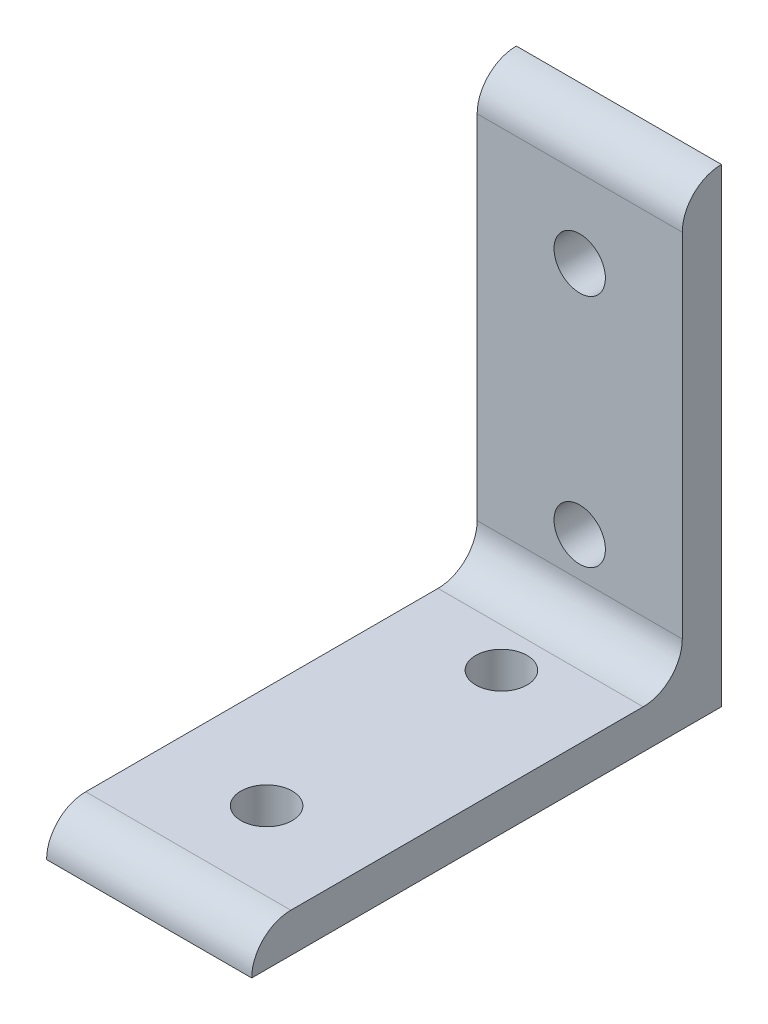
ISO-10303-21;
HEADER;
FILE_DESCRIPTION(('STEP AP214'),'2;1');
FILE_NAME('part.step','',(''),(''),'','','');
FILE_SCHEMA(('AUTOMOTIVE_DESIGN { 1 0 10303 214 1 1 1 1 }'));
ENDSEC;
DATA;
#1=APPLICATION_CONTEXT('core data for automotive mechanical design processes');
#2=APPLICATION_PROTOCOL_DEFINITION('international standard','automotive_design',2000,#1);
#3=PRODUCT_CONTEXT('',#1,'mechanical');
#4=PRODUCT('Part','Part','',(#3));
#5=PRODUCT_RELATED_PRODUCT_CATEGORY('part','',(#4));
#6=PRODUCT_DEFINITION_FORMATION('','',#4);
#7=PRODUCT_DEFINITION_CONTEXT('part definition',#1,'design');
#8=PRODUCT_DEFINITION('design','',#6,#7);
#9=PRODUCT_DEFINITION_SHAPE('','',#8);
#10=(LENGTH_UNIT() NAMED_UNIT(*) SI_UNIT(.MILLI.,.METRE.));
#11=(NAMED_UNIT(*) PLANE_ANGLE_UNIT() SI_UNIT($,.RADIAN.));
#12=(NAMED_UNIT(*) SI_UNIT($,.STERADIAN.) SOLID_ANGLE_UNIT());
#13=UNCERTAINTY_MEASURE_WITH_UNIT(LENGTH_MEASURE(1.E-05),#10,'distance_accuracy_value','');
#14=(GEOMETRIC_REPRESENTATION_CONTEXT(3) GLOBAL_UNCERTAINTY_ASSIGNED_CONTEXT((#13)) GLOBAL_UNIT_ASSIGNED_CONTEXT((#10,
#11,#12)) REPRESENTATION_CONTEXT('',''));
#15=CARTESIAN_POINT('',(0.,0.,0.));
#16=DIRECTION('',(0.,0.,1.));
#17=DIRECTION('',(1.,0.,0.));
#18=AXIS2_PLACEMENT_3D('',#15,#16,#17);
#19=CARTESIAN_POINT('',(-16.637,12.7,12.7));
#20=DIRECTION('',(1.,0.,0.));
#21=DIRECTION('',(0.,0.,-1.));
#22=AXIS2_PLACEMENT_3D('',#19,#20,#21);
#23=CYLINDRICAL_SURFACE('',#22,6.35);
#24=CARTESIAN_POINT('',(16.637,12.7,12.7));
#25=DIRECTION('',(-1.,0.,0.));
#26=DIRECTION('',(0.,0.,-1.));
#27=AXIS2_PLACEMENT_3D('',#24,#25,#26);
#28=CIRCLE('',#27,6.35);
#29=CARTESIAN_POINT('',(16.637,12.7,6.35));
#30=VERTEX_POINT('',#29);
#31=CARTESIAN_POINT('',(16.637,6.35,12.7));
#32=VERTEX_POINT('',#31);
#33=EDGE_CURVE('E126',#30,#32,#28,.T.);
#34=ORIENTED_EDGE('',*,*,#33,.F.);
#35=DIRECTION('',(1.,0.,0.));
#36=VECTOR('',#35,1.);
#37=CARTESIAN_POINT('',(-16.637,12.7,6.35));
#38=LINE('',#37,#36);
#39=CARTESIAN_POINT('',(-16.637,12.7,6.35));
#40=VERTEX_POINT('',#39);
#41=EDGE_CURVE('E11',#40,#30,#38,.T.);
#42=ORIENTED_EDGE('',*,*,#41,.F.);
#43=CARTESIAN_POINT('',(-16.637,12.7,12.7));
#44=DIRECTION('',(-1.,0.,0.));
#45=DIRECTION('',(0.,0.,-1.));
#46=AXIS2_PLACEMENT_3D('',#43,#44,#45);
#47=CIRCLE('',#46,6.35);
#48=CARTESIAN_POINT('',(-16.637,6.35,12.7));
#49=VERTEX_POINT('',#48);
#50=EDGE_CURVE('E143',#40,#49,#47,.T.);
#51=ORIENTED_EDGE('',*,*,#50,.T.);
#52=DIRECTION('',(1.,0.,0.));
#53=VECTOR('',#52,1.);
#54=CARTESIAN_POINT('',(-16.637,6.35,12.7));
#55=LINE('',#54,#53);
#56=EDGE_CURVE('E87',#49,#32,#55,.T.);
#57=ORIENTED_EDGE('',*,*,#56,.T.);
#58=EDGE_LOOP('',(#34,#42,#51,#57));
#59=FACE_BOUND('',#58,.T.);
#60=ADVANCED_FACE('F34',(#59),#23,.F.);
#61=CARTESIAN_POINT('',(-16.637,12.7,6.35));
#62=DIRECTION('',(0.,0.,1.));
#63=DIRECTION('',(0.,-1.,0.));
#64=AXIS2_PLACEMENT_3D('',#61,#62,#63);
#65=PLANE('',#64);
#66=CARTESIAN_POINT('',(0.,57.15,6.35000000000002));
#67=DIRECTION('',(0.,0.,1.));
#68=DIRECTION('',(0.,-1.,0.));
#69=AXIS2_PLACEMENT_3D('',#66,#67,#68);
#70=CIRCLE('',#69,4.1656);
#71=CARTESIAN_POINT('',(0.,61.3156,6.35000000000001));
#72=VERTEX_POINT('',#71);
#73=EDGE_CURVE('E216',#72,#72,#70,.T.);
#74=ORIENTED_EDGE('',*,*,#73,.F.);
#75=EDGE_LOOP('',(#74));
#76=FACE_BOUND('',#75,.T.);
#77=CARTESIAN_POINT('',(0.,19.05,6.35000000000001));
#78=DIRECTION('',(0.,0.,1.));
#79=DIRECTION('',(0.,-1.,0.));
#80=AXIS2_PLACEMENT_3D('',#77,#78,#79);
#81=CIRCLE('',#80,4.1656);
#82=CARTESIAN_POINT('',(0.,23.2156,6.35000000000002));
#83=VERTEX_POINT('',#82);
#84=EDGE_CURVE('E207',#83,#83,#81,.T.);
#85=ORIENTED_EDGE('',*,*,#84,.F.);
#86=EDGE_LOOP('',(#85));
#87=FACE_BOUND('',#86,.T.);
#88=DIRECTION('',(0.,-1.,0.));
#89=VECTOR('',#88,1.);
#90=CARTESIAN_POINT('',(16.637,12.7,6.35));
#91=LINE('',#90,#89);
#92=CARTESIAN_POINT('',(16.637,69.85,6.35000000000001));
#93=VERTEX_POINT('',#92);
#94=EDGE_CURVE('E141',#93,#30,#91,.T.);
#95=ORIENTED_EDGE('',*,*,#94,.F.);
#96=DIRECTION('',(1.,0.,0.));
#97=VECTOR('',#96,1.);
#98=CARTESIAN_POINT('',(-16.637,69.85,6.35000000000001));
#99=LINE('',#98,#97);
#100=CARTESIAN_POINT('',(-16.637,69.85,6.35000000000001));
#101=VERTEX_POINT('',#100);
#102=EDGE_CURVE('E43',#101,#93,#99,.T.);
#103=ORIENTED_EDGE('',*,*,#102,.F.);
#104=DIRECTION('',(0.,-1.,0.));
#105=VECTOR('',#104,1.);
#106=CARTESIAN_POINT('',(-16.637,12.7,6.35));
#107=LINE('',#106,#105);
#108=EDGE_CURVE('E116',#101,#40,#107,.T.);
#109=ORIENTED_EDGE('',*,*,#108,.T.);
#110=ORIENTED_EDGE('',*,*,#41,.T.);
#111=EDGE_LOOP('',(#95,#103,#109,#110));
#112=FACE_BOUND('',#111,.T.);
#113=ADVANCED_FACE('F154',(#76,#87,#112),#65,.T.);
#114=CARTESIAN_POINT('',(-16.637,69.85,0.));
#115=DIRECTION('',(1.,0.,0.));
#116=DIRECTION('',(0.,0.,-1.));
#117=AXIS2_PLACEMENT_3D('',#114,#115,#116);
#118=CYLINDRICAL_SURFACE('',#117,6.34999999999999);
#119=CARTESIAN_POINT('',(16.637,69.85,0.));
#120=DIRECTION('',(1.,0.,0.));
#121=DIRECTION('',(0.,0.,-1.));
#122=AXIS2_PLACEMENT_3D('',#119,#120,#121);
#123=CIRCLE('',#122,6.34999999999999);
#124=CARTESIAN_POINT('',(16.637,76.2,0.));
#125=VERTEX_POINT('',#124);
#126=EDGE_CURVE('E103',#125,#93,#123,.T.);
#127=ORIENTED_EDGE('',*,*,#126,.F.);
#128=DIRECTION('',(1.,0.,0.));
#129=VECTOR('',#128,1.);
#130=CARTESIAN_POINT('',(-16.637,76.2,0.));
#131=LINE('',#130,#129);
#132=CARTESIAN_POINT('',(-16.637,76.2,0.));
#133=VERTEX_POINT('',#132);
#134=EDGE_CURVE('E98',#133,#125,#131,.T.);
#135=ORIENTED_EDGE('',*,*,#134,.F.);
#136=CARTESIAN_POINT('',(-16.637,69.85,0.));
#137=DIRECTION('',(1.,0.,0.));
#138=DIRECTION('',(0.,0.,-1.));
#139=AXIS2_PLACEMENT_3D('',#136,#137,#138);
#140=CIRCLE('',#139,6.34999999999999);
#141=EDGE_CURVE('E101',#133,#101,#140,.T.);
#142=ORIENTED_EDGE('',*,*,#141,.T.);
#143=ORIENTED_EDGE('',*,*,#102,.T.);
#144=EDGE_LOOP('',(#127,#135,#142,#143));
#145=FACE_BOUND('',#144,.T.);
#146=ADVANCED_FACE('F100',(#145),#118,.T.);
#147=CARTESIAN_POINT('',(-16.637,0.,0.));
#148=DIRECTION('',(0.,0.,-1.));
#149=DIRECTION('',(0.,1.,0.));
#150=AXIS2_PLACEMENT_3D('',#147,#148,#149);
#151=PLANE('',#150);
#152=CARTESIAN_POINT('',(0.,57.15,0.));
#153=DIRECTION('',(0.,0.,-1.));
#154=DIRECTION('',(0.,1.,0.));
#155=AXIS2_PLACEMENT_3D('',#152,#153,#154);
#156=CIRCLE('',#155,4.1656);
#157=CARTESIAN_POINT('',(0.,61.3156,0.));
#158=VERTEX_POINT('',#157);
#159=EDGE_CURVE('E213',#158,#158,#156,.T.);
#160=ORIENTED_EDGE('',*,*,#159,.F.);
#161=EDGE_LOOP('',(#160));
#162=FACE_BOUND('',#161,.T.);
#163=CARTESIAN_POINT('',(0.,19.05,0.));
#164=DIRECTION('',(0.,0.,-1.));
#165=DIRECTION('',(0.,1.,0.));
#166=AXIS2_PLACEMENT_3D('',#163,#164,#165);
#167=CIRCLE('',#166,4.1656);
#168=CARTESIAN_POINT('',(0.,23.2156,0.));
#169=VERTEX_POINT('',#168);
#170=EDGE_CURVE('E210',#169,#169,#167,.T.);
#171=ORIENTED_EDGE('',*,*,#170,.F.);
#172=EDGE_LOOP('',(#171));
#173=FACE_BOUND('',#172,.T.);
#174=DIRECTION('',(0.,1.,0.));
#175=VECTOR('',#174,1.);
#176=CARTESIAN_POINT('',(16.637,0.,0.));
#177=LINE('',#176,#175);
#178=CARTESIAN_POINT('',(16.637,0.,0.));
#179=VERTEX_POINT('',#178);
#180=EDGE_CURVE('E138',#179,#125,#177,.T.);
#181=ORIENTED_EDGE('',*,*,#180,.F.);
#182=DIRECTION('',(1.,0.,0.));
#183=VECTOR('',#182,1.);
#184=CARTESIAN_POINT('',(-16.637,0.,0.));
#185=LINE('',#184,#183);
#186=CARTESIAN_POINT('',(-16.637,0.,0.));
#187=VERTEX_POINT('',#186);
#188=EDGE_CURVE('E108',#187,#179,#185,.T.);
#189=ORIENTED_EDGE('',*,*,#188,.F.);
#190=DIRECTION('',(0.,1.,0.));
#191=VECTOR('',#190,1.);
#192=CARTESIAN_POINT('',(-16.637,0.,0.));
#193=LINE('',#192,#191);
#194=EDGE_CURVE('E114',#187,#133,#193,.T.);
#195=ORIENTED_EDGE('',*,*,#194,.T.);
#196=ORIENTED_EDGE('',*,*,#134,.T.);
#197=EDGE_LOOP('',(#181,#189,#195,#196));
#198=FACE_BOUND('',#197,.T.);
#199=ADVANCED_FACE('F118',(#162,#173,#198),#151,.T.);
#200=CARTESIAN_POINT('',(-16.637,0.,76.2));
#201=DIRECTION('',(0.,-1.,0.));
#202=DIRECTION('',(0.,0.,-1.));
#203=AXIS2_PLACEMENT_3D('',#200,#201,#202);
#204=PLANE('',#203);
#205=CARTESIAN_POINT('',(0.,0.,57.15));
#206=DIRECTION('',(0.,-1.,0.));
#207=DIRECTION('',(0.,0.,-1.));
#208=AXIS2_PLACEMENT_3D('',#205,#206,#207);
#209=CIRCLE('',#208,4.1656);
#210=CARTESIAN_POINT('',(0.,0.,52.9844));
#211=VERTEX_POINT('',#210);
#212=EDGE_CURVE('E192',#211,#211,#209,.T.);
#213=ORIENTED_EDGE('',*,*,#212,.F.);
#214=EDGE_LOOP('',(#213));
#215=FACE_BOUND('',#214,.T.);
#216=CARTESIAN_POINT('',(0.,0.,19.05));
#217=DIRECTION('',(0.,-1.,0.));
#218=DIRECTION('',(0.,0.,-1.));
#219=AXIS2_PLACEMENT_3D('',#216,#217,#218);
#220=CIRCLE('',#219,4.1656);
#221=CARTESIAN_POINT('',(0.,0.,14.8844));
#222=VERTEX_POINT('',#221);
#223=EDGE_CURVE('E190',#222,#222,#220,.T.);
#224=ORIENTED_EDGE('',*,*,#223,.F.);
#225=EDGE_LOOP('',(#224));
#226=FACE_BOUND('',#225,.T.);
#227=DIRECTION('',(0.,0.,-1.));
#228=VECTOR('',#227,1.);
#229=CARTESIAN_POINT('',(16.637,0.,76.2));
#230=LINE('',#229,#228);
#231=CARTESIAN_POINT('',(16.637,0.,76.2));
#232=VERTEX_POINT('',#231);
#233=EDGE_CURVE('E135',#232,#179,#230,.T.);
#234=ORIENTED_EDGE('',*,*,#233,.F.);
#235=DIRECTION('',(1.,0.,0.));
#236=VECTOR('',#235,1.);
#237=CARTESIAN_POINT('',(-16.637,0.,76.2));
#238=LINE('',#237,#236);
#239=CARTESIAN_POINT('',(-16.637,0.,76.2));
#240=VERTEX_POINT('',#239);
#241=EDGE_CURVE('E147',#240,#232,#238,.T.);
#242=ORIENTED_EDGE('',*,*,#241,.F.);
#243=DIRECTION('',(0.,0.,-1.));
#244=VECTOR('',#243,1.);
#245=CARTESIAN_POINT('',(-16.637,0.,76.2));
#246=LINE('',#245,#244);
#247=EDGE_CURVE('E119',#240,#187,#246,.T.);
#248=ORIENTED_EDGE('',*,*,#247,.T.);
#249=ORIENTED_EDGE('',*,*,#188,.T.);
#250=EDGE_LOOP('',(#234,#242,#248,#249));
#251=FACE_BOUND('',#250,.T.);
#252=ADVANCED_FACE('F170',(#215,#226,#251),#204,.T.);
#253=CARTESIAN_POINT('',(-16.637,0.,69.85));
#254=DIRECTION('',(1.,0.,0.));
#255=DIRECTION('',(0.,0.,-1.));
#256=AXIS2_PLACEMENT_3D('',#253,#254,#255);
#257=CYLINDRICAL_SURFACE('',#256,6.35);
#258=CARTESIAN_POINT('',(16.637,0.,69.85));
#259=DIRECTION('',(1.,0.,0.));
#260=DIRECTION('',(0.,0.,-1.));
#261=AXIS2_PLACEMENT_3D('',#258,#259,#260);
#262=CIRCLE('',#261,6.35);
#263=CARTESIAN_POINT('',(16.637,6.35,69.85));
#264=VERTEX_POINT('',#263);
#265=EDGE_CURVE('E132',#264,#232,#262,.T.);
#266=ORIENTED_EDGE('',*,*,#265,.F.);
#267=DIRECTION('',(1.,0.,0.));
#268=VECTOR('',#267,1.);
#269=CARTESIAN_POINT('',(-16.637,6.35,69.85));
#270=LINE('',#269,#268);
#271=CARTESIAN_POINT('',(-16.637,6.35,69.85));
#272=VERTEX_POINT('',#271);
#273=EDGE_CURVE('E149',#272,#264,#270,.T.);
#274=ORIENTED_EDGE('',*,*,#273,.F.);
#275=CARTESIAN_POINT('',(-16.637,0.,69.85));
#276=DIRECTION('',(1.,0.,0.));
#277=DIRECTION('',(0.,0.,-1.));
#278=AXIS2_PLACEMENT_3D('',#275,#276,#277);
#279=CIRCLE('',#278,6.35);
#280=EDGE_CURVE('E121',#272,#240,#279,.T.);
#281=ORIENTED_EDGE('',*,*,#280,.T.);
#282=ORIENTED_EDGE('',*,*,#241,.T.);
#283=EDGE_LOOP('',(#266,#274,#281,#282));
#284=FACE_BOUND('',#283,.T.);
#285=ADVANCED_FACE('F174',(#284),#257,.T.);
#286=CARTESIAN_POINT('',(-16.637,6.35,69.85));
#287=DIRECTION('',(0.,1.,0.));
#288=DIRECTION('',(0.,0.,1.));
#289=AXIS2_PLACEMENT_3D('',#286,#287,#288);
#290=PLANE('',#289);
#291=CARTESIAN_POINT('',(0.,6.34999999999999,57.15));
#292=DIRECTION('',(0.,1.,0.));
#293=DIRECTION('',(0.,0.,1.));
#294=AXIS2_PLACEMENT_3D('',#291,#292,#293);
#295=CIRCLE('',#294,4.1656);
#296=CARTESIAN_POINT('',(0.,6.34999999999999,61.3156));
#297=VERTEX_POINT('',#296);
#298=EDGE_CURVE('E186',#297,#297,#295,.T.);
#299=ORIENTED_EDGE('',*,*,#298,.F.);
#300=EDGE_LOOP('',(#299));
#301=FACE_BOUND('',#300,.T.);
#302=CARTESIAN_POINT('',(0.,6.34999999999999,19.05));
#303=DIRECTION('',(0.,1.,0.));
#304=DIRECTION('',(0.,0.,1.));
#305=AXIS2_PLACEMENT_3D('',#302,#303,#304);
#306=CIRCLE('',#305,4.1656);
#307=CARTESIAN_POINT('',(0.,6.34999999999999,23.2156));
#308=VERTEX_POINT('',#307);
#309=EDGE_CURVE('E37',#308,#308,#306,.T.);
#310=ORIENTED_EDGE('',*,*,#309,.F.);
#311=EDGE_LOOP('',(#310));
#312=FACE_BOUND('',#311,.T.);
#313=DIRECTION('',(0.,0.,1.));
#314=VECTOR('',#313,1.);
#315=CARTESIAN_POINT('',(16.637,6.35,69.85));
#316=LINE('',#315,#314);
#317=EDGE_CURVE('E129',#32,#264,#316,.T.);
#318=ORIENTED_EDGE('',*,*,#317,.F.);
#319=ORIENTED_EDGE('',*,*,#56,.F.);
#320=DIRECTION('',(0.,0.,1.));
#321=VECTOR('',#320,1.);
#322=CARTESIAN_POINT('',(-16.637,6.35,69.85));
#323=LINE('',#322,#321);
#324=EDGE_CURVE('E201',#49,#272,#323,.T.);
#325=ORIENTED_EDGE('',*,*,#324,.T.);
#326=ORIENTED_EDGE('',*,*,#273,.T.);
#327=EDGE_LOOP('',(#318,#319,#325,#326));
#328=FACE_BOUND('',#327,.T.);
#329=ADVANCED_FACE('F150',(#301,#312,#328),#290,.T.);
#330=CARTESIAN_POINT('',(-16.637,12.7,12.7));
#331=DIRECTION('',(1.,0.,0.));
#332=DIRECTION('',(0.,0.,-1.));
#333=AXIS2_PLACEMENT_3D('',#330,#331,#332);
#334=PLANE('',#333);
#335=ORIENTED_EDGE('',*,*,#50,.F.);
#336=ORIENTED_EDGE('',*,*,#108,.F.);
#337=ORIENTED_EDGE('',*,*,#141,.F.);
#338=ORIENTED_EDGE('',*,*,#194,.F.);
#339=ORIENTED_EDGE('',*,*,#247,.F.);
#340=ORIENTED_EDGE('',*,*,#280,.F.);
#341=ORIENTED_EDGE('',*,*,#324,.F.);
#342=EDGE_LOOP('',(#335,#336,#337,#338,#339,#340,#341));
#343=FACE_BOUND('',#342,.T.);
#344=ADVANCED_FACE('F112',(#343),#334,.F.);
#345=CARTESIAN_POINT('',(16.637,12.7,12.7));
#346=DIRECTION('',(1.,0.,0.));
#347=DIRECTION('',(0.,0.,-1.));
#348=AXIS2_PLACEMENT_3D('',#345,#346,#347);
#349=PLANE('',#348);
#350=ORIENTED_EDGE('',*,*,#33,.T.);
#351=ORIENTED_EDGE('',*,*,#317,.T.);
#352=ORIENTED_EDGE('',*,*,#265,.T.);
#353=ORIENTED_EDGE('',*,*,#233,.T.);
#354=ORIENTED_EDGE('',*,*,#180,.T.);
#355=ORIENTED_EDGE('',*,*,#126,.T.);
#356=ORIENTED_EDGE('',*,*,#94,.T.);
#357=EDGE_LOOP('',(#350,#351,#352,#353,#354,#355,#356));
#358=FACE_BOUND('',#357,.T.);
#359=ADVANCED_FACE('F153',(#358),#349,.T.);
#360=CARTESIAN_POINT('',(0.,76.2,19.05));
#361=DIRECTION('',(0.,-1.,0.));
#362=DIRECTION('',(0.,0.,-1.));
#363=AXIS2_PLACEMENT_3D('',#360,#361,#362);
#364=CYLINDRICAL_SURFACE('',#363,4.1656);
#365=ORIENTED_EDGE('',*,*,#309,.T.);
#366=EDGE_LOOP('',(#365));
#367=FACE_BOUND('',#366,.T.);
#368=ORIENTED_EDGE('',*,*,#223,.T.);
#369=EDGE_LOOP('',(#368));
#370=FACE_BOUND('',#369,.T.);
#371=ADVANCED_FACE('F235',(#367,#370),#364,.F.);
#372=CARTESIAN_POINT('',(0.,76.2,57.15));
#373=DIRECTION('',(0.,-1.,0.));
#374=DIRECTION('',(0.,0.,-1.));
#375=AXIS2_PLACEMENT_3D('',#372,#373,#374);
#376=CYLINDRICAL_SURFACE('',#375,4.1656);
#377=ORIENTED_EDGE('',*,*,#298,.T.);
#378=EDGE_LOOP('',(#377));
#379=FACE_BOUND('',#378,.T.);
#380=ORIENTED_EDGE('',*,*,#212,.T.);
#381=EDGE_LOOP('',(#380));
#382=FACE_BOUND('',#381,.T.);
#383=ADVANCED_FACE('F229',(#379,#382),#376,.F.);
#384=CARTESIAN_POINT('',(0.,19.05,76.2));
#385=DIRECTION('',(0.,0.,-1.));
#386=DIRECTION('',(0.,1.,0.));
#387=AXIS2_PLACEMENT_3D('',#384,#385,#386);
#388=CYLINDRICAL_SURFACE('',#387,4.1656);
#389=CARTESIAN_POINT('',(0.,23.2156,6.35000000000002));
#390=CARTESIAN_POINT('',(0.,23.2156,6.28385416666669));
#391=CARTESIAN_POINT('',(0.,23.2156,6.21770833333336));
#392=CARTESIAN_POINT('',(0.,23.2156,6.08541666666669));
#393=CARTESIAN_POINT('',(0.,23.2156,6.01927083333335));
#394=CARTESIAN_POINT('',(0.,23.2156,5.88697916666669));
#395=CARTESIAN_POINT('',(0.,23.2156,5.82083333333335));
#396=CARTESIAN_POINT('',(0.,23.2156,5.68854166666669));
#397=CARTESIAN_POINT('',(0.,23.2156,5.62239583333335));
#398=CARTESIAN_POINT('',(0.,23.2156,5.49010416666668));
#399=CARTESIAN_POINT('',(0.,23.2156,5.42395833333335));
#400=CARTESIAN_POINT('',(0.,23.2156,5.29166666666668));
#401=CARTESIAN_POINT('',(0.,23.2156,5.22552083333335));
#402=CARTESIAN_POINT('',(0.,23.2156,5.09322916666668));
#403=CARTESIAN_POINT('',(0.,23.2156,5.02708333333335));
#404=CARTESIAN_POINT('',(0.,23.2156,4.89479166666668));
#405=CARTESIAN_POINT('',(0.,23.2156,4.82864583333335));
#406=CARTESIAN_POINT('',(0.,23.2156,4.69635416666668));
#407=CARTESIAN_POINT('',(0.,23.2156,4.63020833333335));
#408=CARTESIAN_POINT('',(0.,23.2156,4.49791666666668));
#409=CARTESIAN_POINT('',(0.,23.2156,4.43177083333335));
#410=CARTESIAN_POINT('',(0.,23.2156,4.29947916666668));
#411=CARTESIAN_POINT('',(0.,23.2156,4.23333333333335));
#412=CARTESIAN_POINT('',(0.,23.2156,4.10104166666668));
#413=CARTESIAN_POINT('',(0.,23.2156,4.03489583333335));
#414=CARTESIAN_POINT('',(0.,23.2156,3.90260416666668));
#415=CARTESIAN_POINT('',(0.,23.2156,3.83645833333335));
#416=CARTESIAN_POINT('',(0.,23.2156,3.70416666666668));
#417=CARTESIAN_POINT('',(0.,23.2156,3.63802083333335));
#418=CARTESIAN_POINT('',(0.,23.2156,3.50572916666668));
#419=CARTESIAN_POINT('',(0.,23.2156,3.43958333333334));
#420=CARTESIAN_POINT('',(0.,23.2156,3.30729166666667));
#421=CARTESIAN_POINT('',(0.,23.2156,3.24114583333334));
#422=CARTESIAN_POINT('',(0.,23.2156,3.10885416666668));
#423=CARTESIAN_POINT('',(0.,23.2156,3.04270833333335));
#424=CARTESIAN_POINT('',(0.,23.2156,2.91041666666668));
#425=CARTESIAN_POINT('',(0.,23.2156,2.84427083333334));
#426=CARTESIAN_POINT('',(0.,23.2156,2.71197916666667));
#427=CARTESIAN_POINT('',(0.,23.2156,2.64583333333334));
#428=CARTESIAN_POINT('',(0.,23.2156,2.51354166666667));
#429=CARTESIAN_POINT('',(0.,23.2156,2.44739583333334));
#430=CARTESIAN_POINT('',(0.,23.2156,2.31510416666667));
#431=CARTESIAN_POINT('',(0.,23.2156,2.24895833333334));
#432=CARTESIAN_POINT('',(0.,23.2156,2.11666666666667));
#433=CARTESIAN_POINT('',(0.,23.2156,2.05052083333334));
#434=CARTESIAN_POINT('',(0.,23.2156,1.91822916666667));
#435=CARTESIAN_POINT('',(0.,23.2156,1.85208333333334));
#436=CARTESIAN_POINT('',(0.,23.2156,1.71979166666667));
#437=CARTESIAN_POINT('',(0.,23.2156,1.65364583333334));
#438=CARTESIAN_POINT('',(0.,23.2156,1.52135416666667));
#439=CARTESIAN_POINT('',(0.,23.2156,1.45520833333334));
#440=CARTESIAN_POINT('',(0.,23.2156,1.32291666666667));
#441=CARTESIAN_POINT('',(0.,23.2156,1.25677083333334));
#442=CARTESIAN_POINT('',(0.,23.2156,1.12447916666667));
#443=CARTESIAN_POINT('',(0.,23.2156,1.05833333333334));
#444=CARTESIAN_POINT('',(0.,23.2156,0.926041666666673));
#445=CARTESIAN_POINT('',(0.,23.2156,0.859895833333342));
#446=CARTESIAN_POINT('',(0.,23.2156,0.727604166666673));
#447=CARTESIAN_POINT('',(0.,23.2156,0.661458333333337));
#448=CARTESIAN_POINT('',(0.,23.2156,0.529166666666669));
#449=CARTESIAN_POINT('',(0.,23.2156,0.463020833333337));
#450=CARTESIAN_POINT('',(0.,23.2156,0.330729166666668));
#451=CARTESIAN_POINT('',(0.,23.2156,0.264583333333332));
#452=CARTESIAN_POINT('',(0.,23.2156,0.132291666666664));
#453=CARTESIAN_POINT('',(0.,23.2156,0.0661458333333318));
#454=CARTESIAN_POINT('',(0.,23.2156,0.));
#455=B_SPLINE_CURVE_WITH_KNOTS('',3,(#389,#390,#391,#392,#393,#394,#395,#396,#397,#398,#399,
#400,#401,#402,#403,#404,#405,#406,#407,#408,#409,#410,#411,#412,#413,#414,#415,#416,#417,#418,
#419,#420,#421,#422,#423,#424,#425,#426,#427,#428,#429,#430,#431,#432,#433,#434,#435,#436,#437,
#438,#439,#440,#441,#442,#443,#444,#445,#446,#447,#448,#449,#450,#451,#452,#453,#454),
.UNSPECIFIED.,.F.,.F.,(4,2,2,2,2,2,2,2,2,2,2,2,2,2,2,2,2,2,2,2,2,2,2,2,2,2,2,2,2,2,2,2,4),(0.,
0.198437499999995,0.396875000000005,0.5953125,0.79375000000001,0.992187500000005,1.190625,
1.38906250000001,1.58750000000001,1.7859375,1.98437500000001,2.18281250000001,2.38125,
2.57968750000001,2.77812500000001,2.97656250000002,3.17500000000001,3.37343750000001,
3.57187500000002,3.77031250000001,3.96875000000002,4.16718750000002,4.36562500000001,
4.56406250000002,4.76250000000002,4.96093750000001,5.15937500000002,5.35781250000002,
5.55625000000001,5.75468750000002,5.95312500000002,6.15156250000003,6.35000000000002),.UNSPECIFIED.);
#456=EDGE_CURVE('BSEAM222',#83,#169,#455,.T.);
#457=ORIENTED_EDGE('',*,*,#84,.T.);
#458=ORIENTED_EDGE('',*,*,#170,.T.);
#459=ORIENTED_EDGE('',*,*,#456,.T.);
#460=ORIENTED_EDGE('',*,*,#456,.F.);
#461=EDGE_LOOP('',(#457,#459,#458,#460));
#462=FACE_BOUND('',#461,.T.);
#463=ADVANCED_FACE('F222',(#462),#388,.F.);
#464=CARTESIAN_POINT('',(0.,57.15,76.2));
#465=DIRECTION('',(0.,0.,-1.));
#466=DIRECTION('',(0.,1.,0.));
#467=AXIS2_PLACEMENT_3D('',#464,#465,#466);
#468=CYLINDRICAL_SURFACE('',#467,4.1656);
#469=CARTESIAN_POINT('',(0.,61.3156,6.35000000000001));
#470=CARTESIAN_POINT('',(0.,61.3156,6.28385416666668));
#471=CARTESIAN_POINT('',(0.,61.3156,6.21770833333334));
#472=CARTESIAN_POINT('',(0.,61.3156,6.08541666666668));
#473=CARTESIAN_POINT('',(0.,61.3156,6.01927083333334));
#474=CARTESIAN_POINT('',(0.,61.3156,5.88697916666667));
#475=CARTESIAN_POINT('',(0.,61.3156,5.82083333333334));
#476=CARTESIAN_POINT('',(0.,61.3156,5.68854166666668));
#477=CARTESIAN_POINT('',(0.,61.3156,5.62239583333334));
#478=CARTESIAN_POINT('',(0.,61.3156,5.49010416666668));
#479=CARTESIAN_POINT('',(0.,61.3156,5.42395833333334));
#480=CARTESIAN_POINT('',(0.,61.3156,5.29166666666667));
#481=CARTESIAN_POINT('',(0.,61.3156,5.22552083333334));
#482=CARTESIAN_POINT('',(0.,61.3156,5.09322916666668));
#483=CARTESIAN_POINT('',(0.,61.3156,5.02708333333334));
#484=CARTESIAN_POINT('',(0.,61.3156,4.89479166666668));
#485=CARTESIAN_POINT('',(0.,61.3156,4.82864583333335));
#486=CARTESIAN_POINT('',(0.,61.3156,4.69635416666668));
#487=CARTESIAN_POINT('',(0.,61.3156,4.63020833333334));
#488=CARTESIAN_POINT('',(0.,61.3156,4.49791666666668));
#489=CARTESIAN_POINT('',(0.,61.3156,4.43177083333334));
#490=CARTESIAN_POINT('',(0.,61.3156,4.29947916666668));
#491=CARTESIAN_POINT('',(0.,61.3156,4.23333333333335));
#492=CARTESIAN_POINT('',(0.,61.3156,4.10104166666668));
#493=CARTESIAN_POINT('',(0.,61.3156,4.03489583333334));
#494=CARTESIAN_POINT('',(0.,61.3156,3.90260416666668));
#495=CARTESIAN_POINT('',(0.,61.3156,3.83645833333334));
#496=CARTESIAN_POINT('',(0.,61.3156,3.70416666666668));
#497=CARTESIAN_POINT('',(0.,61.3156,3.63802083333335));
#498=CARTESIAN_POINT('',(0.,61.3156,3.50572916666668));
#499=CARTESIAN_POINT('',(0.,61.3156,3.43958333333334));
#500=CARTESIAN_POINT('',(0.,61.3156,3.30729166666667));
#501=CARTESIAN_POINT('',(0.,61.3156,3.24114583333334));
#502=CARTESIAN_POINT('',(0.,61.3156,3.10885416666668));
#503=CARTESIAN_POINT('',(0.,61.3156,3.04270833333335));
#504=CARTESIAN_POINT('',(0.,61.3156,2.91041666666668));
#505=CARTESIAN_POINT('',(0.,61.3156,2.84427083333334));
#506=CARTESIAN_POINT('',(0.,61.3156,2.71197916666667));
#507=CARTESIAN_POINT('',(0.,61.3156,2.64583333333334));
#508=CARTESIAN_POINT('',(0.,61.3156,2.51354166666668));
#509=CARTESIAN_POINT('',(0.,61.3156,2.44739583333335));
#510=CARTESIAN_POINT('',(0.,61.3156,2.31510416666668));
#511=CARTESIAN_POINT('',(0.,61.3156,2.24895833333334));
#512=CARTESIAN_POINT('',(0.,61.3156,2.11666666666667));
#513=CARTESIAN_POINT('',(0.,61.3156,2.05052083333334));
#514=CARTESIAN_POINT('',(0.,61.3156,1.91822916666668));
#515=CARTESIAN_POINT('',(0.,61.3156,1.85208333333335));
#516=CARTESIAN_POINT('',(0.,61.3156,1.71979166666668));
#517=CARTESIAN_POINT('',(0.,61.3156,1.65364583333334));
#518=CARTESIAN_POINT('',(0.,61.3156,1.52135416666667));
#519=CARTESIAN_POINT('',(0.,61.3156,1.45520833333334));
#520=CARTESIAN_POINT('',(0.,61.3156,1.32291666666668));
#521=CARTESIAN_POINT('',(0.,61.3156,1.25677083333335));
#522=CARTESIAN_POINT('',(0.,61.3156,1.12447916666668));
#523=CARTESIAN_POINT('',(0.,61.3156,1.05833333333335));
#524=CARTESIAN_POINT('',(0.,61.3156,0.926041666666683));
#525=CARTESIAN_POINT('',(0.,61.3156,0.859895833333346));
#526=CARTESIAN_POINT('',(0.,61.3156,0.727604166666678));
#527=CARTESIAN_POINT('',(0.,61.3156,0.661458333333346));
#528=CARTESIAN_POINT('',(0.,61.3156,0.529166666666682));
#529=CARTESIAN_POINT('',(0.,61.3156,0.463020833333351));
#530=CARTESIAN_POINT('',(0.,61.3156,0.330729166666682));
#531=CARTESIAN_POINT('',(0.,61.3156,0.264583333333346));
#532=CARTESIAN_POINT('',(0.,61.3156,0.132291666666678));
#533=CARTESIAN_POINT('',(0.,61.3156,0.0661458333333457));
#534=CARTESIAN_POINT('',(0.,61.3156,0.));
#535=B_SPLINE_CURVE_WITH_KNOTS('',3,(#469,#470,#471,#472,#473,#474,#475,#476,#477,#478,#479,
#480,#481,#482,#483,#484,#485,#486,#487,#488,#489,#490,#491,#492,#493,#494,#495,#496,#497,#498,
#499,#500,#501,#502,#503,#504,#505,#506,#507,#508,#509,#510,#511,#512,#513,#514,#515,#516,#517,
#518,#519,#520,#521,#522,#523,#524,#525,#526,#527,#528,#529,#530,#531,#532,#533,#534),
.UNSPECIFIED.,.F.,.F.,(4,2,2,2,2,2,2,2,2,2,2,2,2,2,2,2,2,2,2,2,2,2,2,2,2,2,2,2,2,2,2,2,4),(0.,
0.198437499999995,0.396875000000005,0.5953125,0.793749999999996,0.992187500000005,1.190625,
1.3890625,1.58749999999999,1.7859375,1.984375,2.18281249999999,2.38125,2.5796875,
2.77812499999999,2.9765625,3.175,3.37343749999999,3.571875,3.7703125,3.96874999999999,4.1671875,
4.365625,4.56406249999999,4.7625,4.9609375,5.15937499999999,5.35781249999999,5.55625,
5.75468749999999,5.95312499999999,6.1515625,6.34999999999999),.UNSPECIFIED.);
#536=EDGE_CURVE('BSEAM219',#72,#158,#535,.T.);
#537=ORIENTED_EDGE('',*,*,#73,.T.);
#538=ORIENTED_EDGE('',*,*,#159,.T.);
#539=ORIENTED_EDGE('',*,*,#536,.T.);
#540=ORIENTED_EDGE('',*,*,#536,.F.);
#541=EDGE_LOOP('',(#537,#539,#538,#540));
#542=FACE_BOUND('',#541,.T.);
#543=ADVANCED_FACE('F219',(#542),#468,.F.);
#544=CLOSED_SHELL('',(#60,#113,#146,#199,#252,#285,#329,#344,#359,#371,#383,#463,#543));
#545=MANIFOLD_SOLID_BREP('B2',#544);
#546=ADVANCED_BREP_SHAPE_REPRESENTATION('',(#18,#545),#14);
#547=SHAPE_DEFINITION_REPRESENTATION(#9,#546);
ENDSEC;
END-ISO-10303-21;
